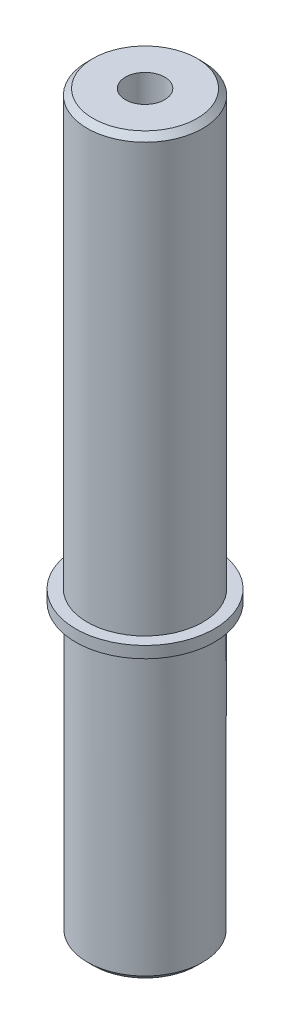
ISO-10303-21;
HEADER;
FILE_DESCRIPTION(('STEP AP214'),'2;1');
FILE_NAME('part.step','',(''),(''),'','','');
FILE_SCHEMA(('AUTOMOTIVE_DESIGN { 1 0 10303 214 1 1 1 1 }'));
ENDSEC;
DATA;
#1=APPLICATION_CONTEXT('core data for automotive mechanical design processes');
#2=APPLICATION_PROTOCOL_DEFINITION('international standard','automotive_design',2000,#1);
#3=PRODUCT_CONTEXT('',#1,'mechanical');
#4=PRODUCT('Part','Part','',(#3));
#5=PRODUCT_RELATED_PRODUCT_CATEGORY('part','',(#4));
#6=PRODUCT_DEFINITION_FORMATION('','',#4);
#7=PRODUCT_DEFINITION_CONTEXT('part definition',#1,'design');
#8=PRODUCT_DEFINITION('design','',#6,#7);
#9=PRODUCT_DEFINITION_SHAPE('','',#8);
#10=(LENGTH_UNIT() NAMED_UNIT(*) SI_UNIT(.MILLI.,.METRE.));
#11=(NAMED_UNIT(*) PLANE_ANGLE_UNIT() SI_UNIT($,.RADIAN.));
#12=(NAMED_UNIT(*) SI_UNIT($,.STERADIAN.) SOLID_ANGLE_UNIT());
#13=UNCERTAINTY_MEASURE_WITH_UNIT(LENGTH_MEASURE(1.E-05),#10,'distance_accuracy_value','');
#14=(GEOMETRIC_REPRESENTATION_CONTEXT(3) GLOBAL_UNCERTAINTY_ASSIGNED_CONTEXT((#13)) GLOBAL_UNIT_ASSIGNED_CONTEXT((#10,
#11,#12)) REPRESENTATION_CONTEXT('',''));
#15=CARTESIAN_POINT('',(0.,0.,0.));
#16=DIRECTION('',(0.,0.,1.));
#17=DIRECTION('',(1.,0.,0.));
#18=AXIS2_PLACEMENT_3D('',#15,#16,#17);
#19=CARTESIAN_POINT('',(0.,0.,9.95));
#20=DIRECTION('',(0.,1.,0.));
#21=DIRECTION('',(0.,0.,1.));
#22=AXIS2_PLACEMENT_3D('',#19,#20,#21);
#23=PLANE('',#22);
#24=CARTESIAN_POINT('',(0.,0.,0.));
#25=DIRECTION('',(0.,1.,0.));
#26=DIRECTION('',(0.,0.,1.));
#27=AXIS2_PLACEMENT_3D('',#24,#25,#26);
#28=CIRCLE('',#27,3.39999999999998);
#29=CARTESIAN_POINT('',(0.,0.,3.39999999999998));
#30=VERTEX_POINT('',#29);
#31=EDGE_CURVE('E69',#30,#30,#28,.T.);
#32=ORIENTED_EDGE('',*,*,#31,.T.);
#33=EDGE_LOOP('',(#32));
#34=FACE_BOUND('',#33,.T.);
#35=CARTESIAN_POINT('',(0.,0.,0.));
#36=DIRECTION('',(0.,1.,0.));
#37=DIRECTION('',(0.,0.,1.));
#38=AXIS2_PLACEMENT_3D('',#35,#36,#37);
#39=CIRCLE('',#38,8.95000000000004);
#40=CARTESIAN_POINT('',(0.,0.,8.95000000000004));
#41=VERTEX_POINT('',#40);
#42=EDGE_CURVE('E52',#41,#41,#39,.F.);
#43=ORIENTED_EDGE('',*,*,#42,.T.);
#44=EDGE_LOOP('',(#43));
#45=FACE_BOUND('',#44,.T.);
#46=ADVANCED_FACE('F37',(#34,#45),#23,.F.);
#47=CARTESIAN_POINT('',(0.,127.,0.));
#48=DIRECTION('',(0.,-1.,0.));
#49=DIRECTION('',(0.,0.,-1.));
#50=AXIS2_PLACEMENT_3D('',#47,#48,#49);
#51=PLANE('',#50);
#52=CARTESIAN_POINT('',(0.,127.,0.));
#53=DIRECTION('',(0.,1.,0.));
#54=DIRECTION('',(0.,0.,1.));
#55=AXIS2_PLACEMENT_3D('',#52,#53,#54);
#56=CIRCLE('',#55,3.39999999999999);
#57=CARTESIAN_POINT('',(0.,127.,3.39999999999999));
#58=VERTEX_POINT('',#57);
#59=EDGE_CURVE('E72',#58,#58,#56,.T.);
#60=ORIENTED_EDGE('',*,*,#59,.F.);
#61=EDGE_LOOP('',(#60));
#62=FACE_BOUND('',#61,.T.);
#63=CARTESIAN_POINT('',(0.,127.,0.));
#64=DIRECTION('',(0.,-1.,0.));
#65=DIRECTION('',(0.,0.,-1.));
#66=AXIS2_PLACEMENT_3D('',#63,#64,#65);
#67=CIRCLE('',#66,9.00000000000002);
#68=CARTESIAN_POINT('',(0.,127.,-9.00000000000002));
#69=VERTEX_POINT('',#68);
#70=EDGE_CURVE('E10',#69,#69,#67,.F.);
#71=ORIENTED_EDGE('',*,*,#70,.T.);
#72=EDGE_LOOP('',(#71));
#73=FACE_BOUND('',#72,.T.);
#74=ADVANCED_FACE('F78',(#62,#73),#51,.F.);
#75=CARTESIAN_POINT('',(0.,0.,0.));
#76=DIRECTION('',(0.,-1.,0.));
#77=DIRECTION('',(0.,0.,-1.));
#78=AXIS2_PLACEMENT_3D('',#75,#76,#77);
#79=CYLINDRICAL_SURFACE('',#78,9.99999999999999);
#80=CARTESIAN_POINT('',(0.,126.,0.));
#81=DIRECTION('',(0.,-1.,0.));
#82=DIRECTION('',(0.,0.,-1.));
#83=AXIS2_PLACEMENT_3D('',#80,#81,#82);
#84=CIRCLE('',#83,9.99999999999999);
#85=CARTESIAN_POINT('',(0.,126.,-9.99999999999999));
#86=VERTEX_POINT('',#85);
#87=EDGE_CURVE('E44',#86,#86,#84,.T.);
#88=ORIENTED_EDGE('',*,*,#87,.T.);
#89=EDGE_LOOP('',(#88));
#90=FACE_BOUND('',#89,.T.);
#91=CARTESIAN_POINT('',(0.,52.,0.));
#92=DIRECTION('',(0.,-1.,0.));
#93=DIRECTION('',(0.,0.,-1.));
#94=AXIS2_PLACEMENT_3D('',#91,#92,#93);
#95=CIRCLE('',#94,9.99999999999999);
#96=CARTESIAN_POINT('',(0.,52.,-9.99999999999999));
#97=VERTEX_POINT('',#96);
#98=EDGE_CURVE('E57',#97,#97,#95,.T.);
#99=ORIENTED_EDGE('',*,*,#98,.F.);
#100=EDGE_LOOP('',(#99));
#101=FACE_BOUND('',#100,.T.);
#102=ADVANCED_FACE('F80',(#90,#101),#79,.T.);
#103=CARTESIAN_POINT('',(0.,52.,9.99999999999999));
#104=DIRECTION('',(0.,-1.,0.));
#105=DIRECTION('',(0.,0.,-1.));
#106=AXIS2_PLACEMENT_3D('',#103,#104,#105);
#107=PLANE('',#106);
#108=CARTESIAN_POINT('',(0.,52.,0.));
#109=DIRECTION('',(0.,-1.,0.));
#110=DIRECTION('',(0.,0.,-1.));
#111=AXIS2_PLACEMENT_3D('',#108,#109,#110);
#112=CIRCLE('',#111,12.);
#113=CARTESIAN_POINT('',(0.,52.,-12.));
#114=VERTEX_POINT('',#113);
#115=EDGE_CURVE('E60',#114,#114,#112,.T.);
#116=ORIENTED_EDGE('',*,*,#115,.F.);
#117=EDGE_LOOP('',(#116));
#118=FACE_BOUND('',#117,.T.);
#119=ORIENTED_EDGE('',*,*,#98,.T.);
#120=EDGE_LOOP('',(#119));
#121=FACE_BOUND('',#120,.T.);
#122=ADVANCED_FACE('F86',(#118,#121),#107,.F.);
#123=CARTESIAN_POINT('',(0.,0.,0.));
#124=DIRECTION('',(0.,-1.,0.));
#125=DIRECTION('',(0.,0.,-1.));
#126=AXIS2_PLACEMENT_3D('',#123,#124,#125);
#127=CYLINDRICAL_SURFACE('',#126,12.);
#128=CARTESIAN_POINT('',(0.,50.,0.));
#129=DIRECTION('',(0.,-1.,0.));
#130=DIRECTION('',(0.,0.,-1.));
#131=AXIS2_PLACEMENT_3D('',#128,#129,#130);
#132=CIRCLE('',#131,12.);
#133=CARTESIAN_POINT('',(0.,50.,-12.));
#134=VERTEX_POINT('',#133);
#135=EDGE_CURVE('E63',#134,#134,#132,.T.);
#136=ORIENTED_EDGE('',*,*,#135,.F.);
#137=EDGE_LOOP('',(#136));
#138=FACE_BOUND('',#137,.T.);
#139=ORIENTED_EDGE('',*,*,#115,.T.);
#140=EDGE_LOOP('',(#139));
#141=FACE_BOUND('',#140,.T.);
#142=ADVANCED_FACE('F112',(#138,#141),#127,.T.);
#143=CARTESIAN_POINT('',(0.,50.,12.));
#144=DIRECTION('',(0.,1.,0.));
#145=DIRECTION('',(0.,0.,1.));
#146=AXIS2_PLACEMENT_3D('',#143,#144,#145);
#147=PLANE('',#146);
#148=CARTESIAN_POINT('',(0.,50.,0.));
#149=DIRECTION('',(0.,-1.,0.));
#150=DIRECTION('',(0.,0.,-1.));
#151=AXIS2_PLACEMENT_3D('',#148,#149,#150);
#152=CIRCLE('',#151,9.95000000000001);
#153=CARTESIAN_POINT('',(0.,50.,-9.95000000000001));
#154=VERTEX_POINT('',#153);
#155=EDGE_CURVE('E66',#154,#154,#152,.T.);
#156=ORIENTED_EDGE('',*,*,#155,.F.);
#157=EDGE_LOOP('',(#156));
#158=FACE_BOUND('',#157,.T.);
#159=ORIENTED_EDGE('',*,*,#135,.T.);
#160=EDGE_LOOP('',(#159));
#161=FACE_BOUND('',#160,.T.);
#162=ADVANCED_FACE('F100',(#158,#161),#147,.F.);
#163=CARTESIAN_POINT('',(0.,0.,0.));
#164=DIRECTION('',(0.,-1.,0.));
#165=DIRECTION('',(0.,0.,-1.));
#166=AXIS2_PLACEMENT_3D('',#163,#164,#165);
#167=CYLINDRICAL_SURFACE('',#166,9.95);
#168=CARTESIAN_POINT('',(0.,0.999999999999971,0.));
#169=DIRECTION('',(0.,1.,0.));
#170=DIRECTION('',(0.,0.,1.));
#171=AXIS2_PLACEMENT_3D('',#168,#169,#170);
#172=CIRCLE('',#171,9.95);
#173=CARTESIAN_POINT('',(0.,0.999999999999971,9.95));
#174=VERTEX_POINT('',#173);
#175=EDGE_CURVE('E48',#174,#174,#172,.T.);
#176=ORIENTED_EDGE('',*,*,#175,.T.);
#177=EDGE_LOOP('',(#176));
#178=FACE_BOUND('',#177,.T.);
#179=ORIENTED_EDGE('',*,*,#155,.T.);
#180=EDGE_LOOP('',(#179));
#181=FACE_BOUND('',#180,.T.);
#182=ADVANCED_FACE('F93',(#178,#181),#167,.T.);
#183=CARTESIAN_POINT('',(0.,0.,0.));
#184=DIRECTION('',(0.,1.,0.));
#185=DIRECTION('',(0.,0.,1.));
#186=AXIS2_PLACEMENT_3D('',#183,#184,#185);
#187=CONICAL_SURFACE('',#186,8.95000000000004,0.785398163397444);
#188=ORIENTED_EDGE('',*,*,#175,.F.);
#189=EDGE_LOOP('',(#188));
#190=FACE_BOUND('',#189,.T.);
#191=ORIENTED_EDGE('',*,*,#42,.F.);
#192=EDGE_LOOP('',(#191));
#193=FACE_BOUND('',#192,.T.);
#194=ADVANCED_FACE('F91',(#190,#193),#187,.T.);
#195=CARTESIAN_POINT('',(0.,126.,0.));
#196=DIRECTION('',(0.,-1.,0.));
#197=DIRECTION('',(0.,0.,-1.));
#198=AXIS2_PLACEMENT_3D('',#195,#196,#197);
#199=CONICAL_SURFACE('',#198,9.99999999999999,0.785398163397448);
#200=ORIENTED_EDGE('',*,*,#70,.F.);
#201=EDGE_LOOP('',(#200));
#202=FACE_BOUND('',#201,.T.);
#203=ORIENTED_EDGE('',*,*,#87,.F.);
#204=EDGE_LOOP('',(#203));
#205=FACE_BOUND('',#204,.T.);
#206=ADVANCED_FACE('F39',(#202,#205),#199,.T.);
#207=CARTESIAN_POINT('',(0.,127.,0.));
#208=DIRECTION('',(0.,1.,0.));
#209=DIRECTION('',(0.,0.,1.));
#210=AXIS2_PLACEMENT_3D('',#207,#208,#209);
#211=CYLINDRICAL_SURFACE('',#210,3.39999999999999);
#212=ORIENTED_EDGE('',*,*,#31,.F.);
#213=EDGE_LOOP('',(#212));
#214=FACE_BOUND('',#213,.T.);
#215=ORIENTED_EDGE('',*,*,#59,.T.);
#216=EDGE_LOOP('',(#215));
#217=FACE_BOUND('',#216,.T.);
#218=ADVANCED_FACE('F76',(#214,#217),#211,.F.);
#219=CLOSED_SHELL('',(#46,#74,#102,#122,#142,#162,#182,#194,#206,#218));
#220=MANIFOLD_SOLID_BREP('B2',#219);
#221=ADVANCED_BREP_SHAPE_REPRESENTATION('',(#18,#220),#14);
#222=SHAPE_DEFINITION_REPRESENTATION(#9,#221);
ENDSEC;
END-ISO-10303-21;
